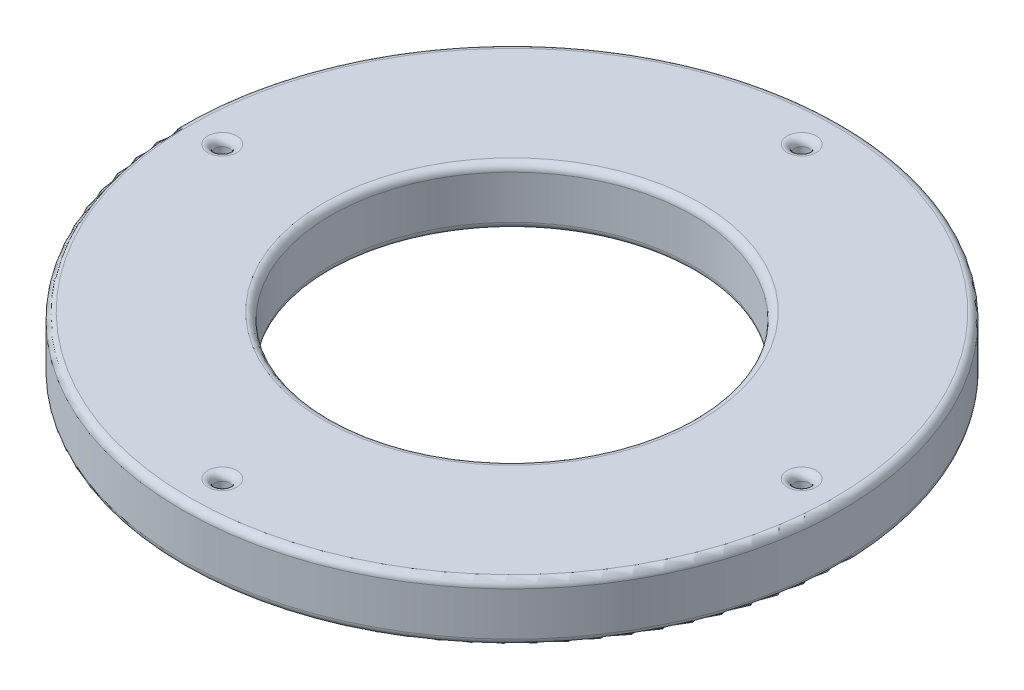
ISO-10303-21;
HEADER;
FILE_DESCRIPTION(('STEP AP214'),'2;1');
FILE_NAME('part.step','',(''),(''),'','','');
FILE_SCHEMA(('AUTOMOTIVE_DESIGN { 1 0 10303 214 1 1 1 1 }'));
ENDSEC;
DATA;
#1=APPLICATION_CONTEXT('core data for automotive mechanical design processes');
#2=APPLICATION_PROTOCOL_DEFINITION('international standard','automotive_design',2000,#1);
#3=PRODUCT_CONTEXT('',#1,'mechanical');
#4=PRODUCT('Part','Part','',(#3));
#5=PRODUCT_RELATED_PRODUCT_CATEGORY('part','',(#4));
#6=PRODUCT_DEFINITION_FORMATION('','',#4);
#7=PRODUCT_DEFINITION_CONTEXT('part definition',#1,'design');
#8=PRODUCT_DEFINITION('design','',#6,#7);
#9=PRODUCT_DEFINITION_SHAPE('','',#8);
#10=(LENGTH_UNIT() NAMED_UNIT(*) SI_UNIT(.MILLI.,.METRE.));
#11=(NAMED_UNIT(*) PLANE_ANGLE_UNIT() SI_UNIT($,.RADIAN.));
#12=(NAMED_UNIT(*) SI_UNIT($,.STERADIAN.) SOLID_ANGLE_UNIT());
#13=UNCERTAINTY_MEASURE_WITH_UNIT(LENGTH_MEASURE(1.E-05),#10,'distance_accuracy_value','');
#14=(GEOMETRIC_REPRESENTATION_CONTEXT(3) GLOBAL_UNCERTAINTY_ASSIGNED_CONTEXT((#13)) GLOBAL_UNIT_ASSIGNED_CONTEXT((#10,
#11,#12)) REPRESENTATION_CONTEXT('',''));
#15=CARTESIAN_POINT('',(0.,0.,0.));
#16=DIRECTION('',(0.,0.,1.));
#17=DIRECTION('',(1.,0.,0.));
#18=AXIS2_PLACEMENT_3D('',#15,#16,#17);
#19=CARTESIAN_POINT('',(0.,4.,0.));
#20=DIRECTION('',(0.,1.,0.));
#21=DIRECTION('',(0.,0.,1.));
#22=AXIS2_PLACEMENT_3D('',#19,#20,#21);
#23=PLANE('',#22);
#24=CARTESIAN_POINT('',(20.,4.,0.));
#25=DIRECTION('',(0.,1.,0.));
#26=DIRECTION('',(0.,0.,1.));
#27=AXIS2_PLACEMENT_3D('',#24,#25,#26);
#28=CIRCLE('',#27,0.999999999999999);
#29=CARTESIAN_POINT('',(20.,4.,0.999999999999999));
#30=VERTEX_POINT('',#29);
#31=EDGE_CURVE('E70',#30,#30,#28,.F.);
#32=ORIENTED_EDGE('',*,*,#31,.T.);
#33=EDGE_LOOP('',(#32));
#34=FACE_BOUND('',#33,.T.);
#35=CARTESIAN_POINT('',(2.09488880330588E-13,4.,-20.));
#36=DIRECTION('',(0.,1.,0.));
#37=DIRECTION('',(0.,0.,1.));
#38=AXIS2_PLACEMENT_3D('',#35,#36,#37);
#39=CIRCLE('',#38,0.999999999999998);
#40=CARTESIAN_POINT('',(2.09488880330588E-13,4.,-19.));
#41=VERTEX_POINT('',#40);
#42=EDGE_CURVE('E74',#41,#41,#39,.F.);
#43=ORIENTED_EDGE('',*,*,#42,.T.);
#44=EDGE_LOOP('',(#43));
#45=FACE_BOUND('',#44,.T.);
#46=CARTESIAN_POINT('',(-20.,4.,-1.39659253553725E-13));
#47=DIRECTION('',(0.,1.,0.));
#48=DIRECTION('',(0.,0.,1.));
#49=AXIS2_PLACEMENT_3D('',#46,#47,#48);
#50=CIRCLE('',#49,0.999999999999998);
#51=CARTESIAN_POINT('',(-20.,4.,0.999999999999859));
#52=VERTEX_POINT('',#51);
#53=EDGE_CURVE('E78',#52,#52,#50,.F.);
#54=ORIENTED_EDGE('',*,*,#53,.T.);
#55=EDGE_LOOP('',(#54));
#56=FACE_BOUND('',#55,.T.);
#57=CARTESIAN_POINT('',(0.,4.,20.));
#58=DIRECTION('',(0.,1.,0.));
#59=DIRECTION('',(0.,0.,1.));
#60=AXIS2_PLACEMENT_3D('',#57,#58,#59);
#61=CIRCLE('',#60,0.999999999999999);
#62=CARTESIAN_POINT('',(0.,4.,21.));
#63=VERTEX_POINT('',#62);
#64=EDGE_CURVE('E82',#63,#63,#61,.F.);
#65=ORIENTED_EDGE('',*,*,#64,.T.);
#66=EDGE_LOOP('',(#65));
#67=FACE_BOUND('',#66,.T.);
#68=CARTESIAN_POINT('',(0.,4.,0.));
#69=DIRECTION('',(0.,1.,0.));
#70=DIRECTION('',(0.,0.,1.));
#71=AXIS2_PLACEMENT_3D('',#68,#69,#70);
#72=CIRCLE('',#71,13.);
#73=CARTESIAN_POINT('',(0.,4.,13.));
#74=VERTEX_POINT('',#73);
#75=EDGE_CURVE('E118',#74,#74,#72,.F.);
#76=ORIENTED_EDGE('',*,*,#75,.T.);
#77=EDGE_LOOP('',(#76));
#78=FACE_BOUND('',#77,.T.);
#79=CARTESIAN_POINT('',(0.,4.,0.));
#80=DIRECTION('',(0.,1.,0.));
#81=DIRECTION('',(0.,0.,1.));
#82=AXIS2_PLACEMENT_3D('',#79,#80,#81);
#83=CIRCLE('',#82,22.25);
#84=CARTESIAN_POINT('',(0.,4.,22.25));
#85=VERTEX_POINT('',#84);
#86=EDGE_CURVE('E122',#85,#85,#83,.T.);
#87=ORIENTED_EDGE('',*,*,#86,.T.);
#88=EDGE_LOOP('',(#87));
#89=FACE_BOUND('',#88,.T.);
#90=ADVANCED_FACE('F38',(#34,#45,#56,#67,#78,#89),#23,.T.);
#91=CARTESIAN_POINT('',(0.,0.,0.));
#92=DIRECTION('',(0.,1.,0.));
#93=DIRECTION('',(0.,0.,1.));
#94=AXIS2_PLACEMENT_3D('',#91,#92,#93);
#95=PLANE('',#94);
#96=CARTESIAN_POINT('',(20.,0.,0.));
#97=DIRECTION('',(0.,1.,0.));
#98=DIRECTION('',(0.,0.,1.));
#99=AXIS2_PLACEMENT_3D('',#96,#97,#98);
#100=CIRCLE('',#99,0.999999999999999);
#101=CARTESIAN_POINT('',(20.,0.,0.999999999999999));
#102=VERTEX_POINT('',#101);
#103=EDGE_CURVE('E94',#102,#102,#100,.T.);
#104=ORIENTED_EDGE('',*,*,#103,.T.);
#105=EDGE_LOOP('',(#104));
#106=FACE_BOUND('',#105,.T.);
#107=CARTESIAN_POINT('',(2.09488880330588E-13,0.,-20.));
#108=DIRECTION('',(0.,1.,0.));
#109=DIRECTION('',(0.,0.,1.));
#110=AXIS2_PLACEMENT_3D('',#107,#108,#109);
#111=CIRCLE('',#110,0.999999999999998);
#112=CARTESIAN_POINT('',(2.09488880330588E-13,0.,-19.));
#113=VERTEX_POINT('',#112);
#114=EDGE_CURVE('E98',#113,#113,#111,.T.);
#115=ORIENTED_EDGE('',*,*,#114,.T.);
#116=EDGE_LOOP('',(#115));
#117=FACE_BOUND('',#116,.T.);
#118=CARTESIAN_POINT('',(-20.,0.,-1.39659253553725E-13));
#119=DIRECTION('',(0.,1.,0.));
#120=DIRECTION('',(0.,0.,1.));
#121=AXIS2_PLACEMENT_3D('',#118,#119,#120);
#122=CIRCLE('',#121,0.999999999999998);
#123=CARTESIAN_POINT('',(-20.,0.,0.999999999999859));
#124=VERTEX_POINT('',#123);
#125=EDGE_CURVE('E102',#124,#124,#122,.T.);
#126=ORIENTED_EDGE('',*,*,#125,.T.);
#127=EDGE_LOOP('',(#126));
#128=FACE_BOUND('',#127,.T.);
#129=CARTESIAN_POINT('',(0.,0.,20.));
#130=DIRECTION('',(0.,1.,0.));
#131=DIRECTION('',(0.,0.,1.));
#132=AXIS2_PLACEMENT_3D('',#129,#130,#131);
#133=CIRCLE('',#132,0.999999999999999);
#134=CARTESIAN_POINT('',(0.,0.,21.));
#135=VERTEX_POINT('',#134);
#136=EDGE_CURVE('E106',#135,#135,#133,.T.);
#137=ORIENTED_EDGE('',*,*,#136,.T.);
#138=EDGE_LOOP('',(#137));
#139=FACE_BOUND('',#138,.T.);
#140=CARTESIAN_POINT('',(0.,0.,0.));
#141=DIRECTION('',(0.,1.,0.));
#142=DIRECTION('',(0.,0.,1.));
#143=AXIS2_PLACEMENT_3D('',#140,#141,#142);
#144=CIRCLE('',#143,13.);
#145=CARTESIAN_POINT('',(0.,0.,13.));
#146=VERTEX_POINT('',#145);
#147=EDGE_CURVE('E134',#146,#146,#144,.T.);
#148=ORIENTED_EDGE('',*,*,#147,.T.);
#149=EDGE_LOOP('',(#148));
#150=FACE_BOUND('',#149,.T.);
#151=CARTESIAN_POINT('',(0.,0.,0.));
#152=DIRECTION('',(0.,1.,0.));
#153=DIRECTION('',(0.,0.,1.));
#154=AXIS2_PLACEMENT_3D('',#151,#152,#153);
#155=CIRCLE('',#154,22.25);
#156=CARTESIAN_POINT('',(0.,0.,22.25));
#157=VERTEX_POINT('',#156);
#158=EDGE_CURVE('E138',#157,#157,#155,.F.);
#159=ORIENTED_EDGE('',*,*,#158,.T.);
#160=EDGE_LOOP('',(#159));
#161=FACE_BOUND('',#160,.T.);
#162=ADVANCED_FACE('F143',(#106,#117,#128,#139,#150,#161),#95,.F.);
#163=CARTESIAN_POINT('',(0.,4.,0.));
#164=DIRECTION('',(0.,-1.,0.));
#165=DIRECTION('',(0.,0.,-1.));
#166=AXIS2_PLACEMENT_3D('',#163,#164,#165);
#167=CYLINDRICAL_SURFACE('',#166,22.75);
#168=CARTESIAN_POINT('',(0.,0.5,0.));
#169=DIRECTION('',(0.,1.,0.));
#170=DIRECTION('',(0.,0.,1.));
#171=AXIS2_PLACEMENT_3D('',#168,#169,#170);
#172=CIRCLE('',#171,22.75);
#173=CARTESIAN_POINT('',(0.,0.5,22.75));
#174=VERTEX_POINT('',#173);
#175=EDGE_CURVE('E110',#174,#174,#172,.T.);
#176=ORIENTED_EDGE('',*,*,#175,.T.);
#177=EDGE_LOOP('',(#176));
#178=FACE_BOUND('',#177,.T.);
#179=CARTESIAN_POINT('',(0.,3.5,0.));
#180=DIRECTION('',(0.,1.,0.));
#181=DIRECTION('',(0.,0.,1.));
#182=AXIS2_PLACEMENT_3D('',#179,#180,#181);
#183=CIRCLE('',#182,22.75);
#184=CARTESIAN_POINT('',(0.,3.5,22.75));
#185=VERTEX_POINT('',#184);
#186=EDGE_CURVE('E114',#185,#185,#183,.F.);
#187=ORIENTED_EDGE('',*,*,#186,.T.);
#188=EDGE_LOOP('',(#187));
#189=FACE_BOUND('',#188,.T.);
#190=ADVANCED_FACE('F153',(#178,#189),#167,.T.);
#191=CARTESIAN_POINT('',(0.,4.,0.));
#192=DIRECTION('',(0.,-1.,0.));
#193=DIRECTION('',(0.,0.,-1.));
#194=AXIS2_PLACEMENT_3D('',#191,#192,#193);
#195=CYLINDRICAL_SURFACE('',#194,12.5);
#196=CARTESIAN_POINT('',(0.,0.5,0.));
#197=DIRECTION('',(0.,1.,0.));
#198=DIRECTION('',(0.,0.,1.));
#199=AXIS2_PLACEMENT_3D('',#196,#197,#198);
#200=CIRCLE('',#199,12.5);
#201=CARTESIAN_POINT('',(0.,0.5,12.5));
#202=VERTEX_POINT('',#201);
#203=EDGE_CURVE('E126',#202,#202,#200,.F.);
#204=ORIENTED_EDGE('',*,*,#203,.T.);
#205=EDGE_LOOP('',(#204));
#206=FACE_BOUND('',#205,.T.);
#207=CARTESIAN_POINT('',(0.,3.5,0.));
#208=DIRECTION('',(0.,1.,0.));
#209=DIRECTION('',(0.,0.,1.));
#210=AXIS2_PLACEMENT_3D('',#207,#208,#209);
#211=CIRCLE('',#210,12.5);
#212=CARTESIAN_POINT('',(0.,3.5,12.5));
#213=VERTEX_POINT('',#212);
#214=EDGE_CURVE('E130',#213,#213,#211,.T.);
#215=ORIENTED_EDGE('',*,*,#214,.T.);
#216=EDGE_LOOP('',(#215));
#217=FACE_BOUND('',#216,.T.);
#218=ADVANCED_FACE('F156',(#206,#217),#195,.F.);
#219=CARTESIAN_POINT('',(20.,4.,0.));
#220=DIRECTION('',(0.,-1.,0.));
#221=DIRECTION('',(0.,0.,-1.));
#222=AXIS2_PLACEMENT_3D('',#219,#220,#221);
#223=CYLINDRICAL_SURFACE('',#222,0.499999999999999);
#224=CARTESIAN_POINT('',(20.,0.5,0.));
#225=DIRECTION('',(0.,1.,0.));
#226=DIRECTION('',(0.,0.,1.));
#227=AXIS2_PLACEMENT_3D('',#224,#225,#226);
#228=CIRCLE('',#227,0.499999999999999);
#229=CARTESIAN_POINT('',(20.,0.5,0.499999999999999));
#230=VERTEX_POINT('',#229);
#231=EDGE_CURVE('E86',#230,#230,#228,.F.);
#232=ORIENTED_EDGE('',*,*,#231,.T.);
#233=EDGE_LOOP('',(#232));
#234=FACE_BOUND('',#233,.T.);
#235=CARTESIAN_POINT('',(20.,3.5,0.));
#236=DIRECTION('',(0.,1.,0.));
#237=DIRECTION('',(0.,0.,1.));
#238=AXIS2_PLACEMENT_3D('',#235,#236,#237);
#239=CIRCLE('',#238,0.499999999999999);
#240=CARTESIAN_POINT('',(20.,3.5,0.499999999999999));
#241=VERTEX_POINT('',#240);
#242=EDGE_CURVE('E90',#241,#241,#239,.T.);
#243=ORIENTED_EDGE('',*,*,#242,.T.);
#244=EDGE_LOOP('',(#243));
#245=FACE_BOUND('',#244,.T.);
#246=ADVANCED_FACE('F233',(#234,#245),#223,.F.);
#247=CARTESIAN_POINT('',(0.,4.,20.));
#248=DIRECTION('',(0.,-1.,0.));
#249=DIRECTION('',(0.,0.,-1.));
#250=AXIS2_PLACEMENT_3D('',#247,#248,#249);
#251=CYLINDRICAL_SURFACE('',#250,0.499999999999999);
#252=CARTESIAN_POINT('',(0.,0.5,20.));
#253=DIRECTION('',(0.,1.,0.));
#254=DIRECTION('',(0.,0.,1.));
#255=AXIS2_PLACEMENT_3D('',#252,#253,#254);
#256=CIRCLE('',#255,0.499999999999999);
#257=CARTESIAN_POINT('',(0.,0.5,20.5));
#258=VERTEX_POINT('',#257);
#259=EDGE_CURVE('E10',#258,#258,#256,.F.);
#260=ORIENTED_EDGE('',*,*,#259,.T.);
#261=EDGE_LOOP('',(#260));
#262=FACE_BOUND('',#261,.T.);
#263=CARTESIAN_POINT('',(0.,3.5,20.));
#264=DIRECTION('',(0.,1.,0.));
#265=DIRECTION('',(0.,0.,1.));
#266=AXIS2_PLACEMENT_3D('',#263,#264,#265);
#267=CIRCLE('',#266,0.499999999999999);
#268=CARTESIAN_POINT('',(0.,3.5,20.5));
#269=VERTEX_POINT('',#268);
#270=EDGE_CURVE('E46',#269,#269,#267,.T.);
#271=ORIENTED_EDGE('',*,*,#270,.T.);
#272=EDGE_LOOP('',(#271));
#273=FACE_BOUND('',#272,.T.);
#274=ADVANCED_FACE('F239',(#262,#273),#251,.F.);
#275=CARTESIAN_POINT('',(-20.,4.,-1.39659253553725E-13));
#276=DIRECTION('',(0.,-1.,0.));
#277=DIRECTION('',(0.,0.,-1.));
#278=AXIS2_PLACEMENT_3D('',#275,#276,#277);
#279=CYLINDRICAL_SURFACE('',#278,0.499999999999998);
#280=CARTESIAN_POINT('',(-20.,0.5,-1.39659253553725E-13));
#281=DIRECTION('',(0.,1.,0.));
#282=DIRECTION('',(0.,0.,1.));
#283=AXIS2_PLACEMENT_3D('',#280,#281,#282);
#284=CIRCLE('',#283,0.499999999999998);
#285=CARTESIAN_POINT('',(-20.,0.5,0.499999999999859));
#286=VERTEX_POINT('',#285);
#287=EDGE_CURVE('E51',#286,#286,#284,.F.);
#288=ORIENTED_EDGE('',*,*,#287,.T.);
#289=EDGE_LOOP('',(#288));
#290=FACE_BOUND('',#289,.T.);
#291=CARTESIAN_POINT('',(-20.,3.5,-1.39659253553725E-13));
#292=DIRECTION('',(0.,1.,0.));
#293=DIRECTION('',(0.,0.,1.));
#294=AXIS2_PLACEMENT_3D('',#291,#292,#293);
#295=CIRCLE('',#294,0.499999999999998);
#296=CARTESIAN_POINT('',(-20.,3.5,0.499999999999859));
#297=VERTEX_POINT('',#296);
#298=EDGE_CURVE('E56',#297,#297,#295,.T.);
#299=ORIENTED_EDGE('',*,*,#298,.T.);
#300=EDGE_LOOP('',(#299));
#301=FACE_BOUND('',#300,.T.);
#302=ADVANCED_FACE('F244',(#290,#301),#279,.F.);
#303=CARTESIAN_POINT('',(2.09488880330588E-13,4.,-20.));
#304=DIRECTION('',(0.,-1.,0.));
#305=DIRECTION('',(0.,0.,-1.));
#306=AXIS2_PLACEMENT_3D('',#303,#304,#305);
#307=CYLINDRICAL_SURFACE('',#306,0.499999999999998);
#308=CARTESIAN_POINT('',(2.09488880330588E-13,0.5,-20.));
#309=DIRECTION('',(0.,1.,0.));
#310=DIRECTION('',(0.,0.,1.));
#311=AXIS2_PLACEMENT_3D('',#308,#309,#310);
#312=CIRCLE('',#311,0.499999999999998);
#313=CARTESIAN_POINT('',(2.09488880330588E-13,0.5,-19.5));
#314=VERTEX_POINT('',#313);
#315=EDGE_CURVE('E62',#314,#314,#312,.F.);
#316=ORIENTED_EDGE('',*,*,#315,.T.);
#317=EDGE_LOOP('',(#316));
#318=FACE_BOUND('',#317,.T.);
#319=CARTESIAN_POINT('',(2.09488880330588E-13,3.5,-20.));
#320=DIRECTION('',(0.,1.,0.));
#321=DIRECTION('',(0.,0.,1.));
#322=AXIS2_PLACEMENT_3D('',#319,#320,#321);
#323=CIRCLE('',#322,0.499999999999998);
#324=CARTESIAN_POINT('',(2.09488880330588E-13,3.5,-19.5));
#325=VERTEX_POINT('',#324);
#326=EDGE_CURVE('E66',#325,#325,#323,.T.);
#327=ORIENTED_EDGE('',*,*,#326,.T.);
#328=EDGE_LOOP('',(#327));
#329=FACE_BOUND('',#328,.T.);
#330=ADVANCED_FACE('F182',(#318,#329),#307,.F.);
#331=CARTESIAN_POINT('',(0.,0.5,0.));
#332=DIRECTION('',(0.,1.,0.));
#333=DIRECTION('',(0.,0.,1.));
#334=AXIS2_PLACEMENT_3D('',#331,#332,#333);
#335=TOROIDAL_SURFACE('',#334,13.,0.5);
#336=ORIENTED_EDGE('',*,*,#203,.F.);
#337=EDGE_LOOP('',(#336));
#338=FACE_BOUND('',#337,.T.);
#339=ORIENTED_EDGE('',*,*,#147,.F.);
#340=EDGE_LOOP('',(#339));
#341=FACE_BOUND('',#340,.T.);
#342=ADVANCED_FACE('F179',(#338,#341),#335,.T.);
#343=CARTESIAN_POINT('',(0.,3.5,0.));
#344=DIRECTION('',(0.,1.,0.));
#345=DIRECTION('',(0.,0.,1.));
#346=AXIS2_PLACEMENT_3D('',#343,#344,#345);
#347=TOROIDAL_SURFACE('',#346,13.,0.5);
#348=ORIENTED_EDGE('',*,*,#75,.F.);
#349=EDGE_LOOP('',(#348));
#350=FACE_BOUND('',#349,.T.);
#351=ORIENTED_EDGE('',*,*,#214,.F.);
#352=EDGE_LOOP('',(#351));
#353=FACE_BOUND('',#352,.T.);
#354=ADVANCED_FACE('F149',(#350,#353),#347,.T.);
#355=CARTESIAN_POINT('',(0.,0.5,0.));
#356=DIRECTION('',(0.,1.,0.));
#357=DIRECTION('',(0.,0.,1.));
#358=AXIS2_PLACEMENT_3D('',#355,#356,#357);
#359=TOROIDAL_SURFACE('',#358,22.25,0.5);
#360=ORIENTED_EDGE('',*,*,#158,.F.);
#361=EDGE_LOOP('',(#360));
#362=FACE_BOUND('',#361,.T.);
#363=ORIENTED_EDGE('',*,*,#175,.F.);
#364=EDGE_LOOP('',(#363));
#365=FACE_BOUND('',#364,.T.);
#366=ADVANCED_FACE('F145',(#362,#365),#359,.T.);
#367=CARTESIAN_POINT('',(0.,3.5,0.));
#368=DIRECTION('',(0.,1.,0.));
#369=DIRECTION('',(0.,0.,1.));
#370=AXIS2_PLACEMENT_3D('',#367,#368,#369);
#371=TOROIDAL_SURFACE('',#370,22.25,0.5);
#372=ORIENTED_EDGE('',*,*,#186,.F.);
#373=EDGE_LOOP('',(#372));
#374=FACE_BOUND('',#373,.T.);
#375=ORIENTED_EDGE('',*,*,#86,.F.);
#376=EDGE_LOOP('',(#375));
#377=FACE_BOUND('',#376,.T.);
#378=ADVANCED_FACE('F148',(#374,#377),#371,.T.);
#379=CARTESIAN_POINT('',(20.,0.5,0.));
#380=DIRECTION('',(0.,1.,0.));
#381=DIRECTION('',(0.,0.,1.));
#382=AXIS2_PLACEMENT_3D('',#379,#380,#381);
#383=TOROIDAL_SURFACE('',#382,0.999999999999999,0.5);
#384=ORIENTED_EDGE('',*,*,#231,.F.);
#385=EDGE_LOOP('',(#384));
#386=FACE_BOUND('',#385,.T.);
#387=ORIENTED_EDGE('',*,*,#103,.F.);
#388=EDGE_LOOP('',(#387));
#389=FACE_BOUND('',#388,.T.);
#390=ADVANCED_FACE('F162',(#386,#389),#383,.T.);
#391=CARTESIAN_POINT('',(20.,3.5,0.));
#392=DIRECTION('',(0.,1.,0.));
#393=DIRECTION('',(0.,0.,1.));
#394=AXIS2_PLACEMENT_3D('',#391,#392,#393);
#395=TOROIDAL_SURFACE('',#394,0.999999999999999,0.5);
#396=ORIENTED_EDGE('',*,*,#31,.F.);
#397=EDGE_LOOP('',(#396));
#398=FACE_BOUND('',#397,.T.);
#399=ORIENTED_EDGE('',*,*,#242,.F.);
#400=EDGE_LOOP('',(#399));
#401=FACE_BOUND('',#400,.T.);
#402=ADVANCED_FACE('F189',(#398,#401),#395,.T.);
#403=CARTESIAN_POINT('',(2.09488880330588E-13,0.5,-20.));
#404=DIRECTION('',(0.,1.,0.));
#405=DIRECTION('',(0.,0.,1.));
#406=AXIS2_PLACEMENT_3D('',#403,#404,#405);
#407=TOROIDAL_SURFACE('',#406,0.999999999999998,0.5);
#408=ORIENTED_EDGE('',*,*,#315,.F.);
#409=EDGE_LOOP('',(#408));
#410=FACE_BOUND('',#409,.T.);
#411=ORIENTED_EDGE('',*,*,#114,.F.);
#412=EDGE_LOOP('',(#411));
#413=FACE_BOUND('',#412,.T.);
#414=ADVANCED_FACE('F193',(#410,#413),#407,.T.);
#415=CARTESIAN_POINT('',(2.09488880330588E-13,3.5,-20.));
#416=DIRECTION('',(0.,1.,0.));
#417=DIRECTION('',(0.,0.,1.));
#418=AXIS2_PLACEMENT_3D('',#415,#416,#417);
#419=TOROIDAL_SURFACE('',#418,0.999999999999998,0.5);
#420=ORIENTED_EDGE('',*,*,#42,.F.);
#421=EDGE_LOOP('',(#420));
#422=FACE_BOUND('',#421,.T.);
#423=ORIENTED_EDGE('',*,*,#326,.F.);
#424=EDGE_LOOP('',(#423));
#425=FACE_BOUND('',#424,.T.);
#426=ADVANCED_FACE('F197',(#422,#425),#419,.T.);
#427=CARTESIAN_POINT('',(-20.,0.5,-1.39659253553725E-13));
#428=DIRECTION('',(0.,1.,0.));
#429=DIRECTION('',(0.,0.,1.));
#430=AXIS2_PLACEMENT_3D('',#427,#428,#429);
#431=TOROIDAL_SURFACE('',#430,0.999999999999998,0.5);
#432=ORIENTED_EDGE('',*,*,#287,.F.);
#433=EDGE_LOOP('',(#432));
#434=FACE_BOUND('',#433,.T.);
#435=ORIENTED_EDGE('',*,*,#125,.F.);
#436=EDGE_LOOP('',(#435));
#437=FACE_BOUND('',#436,.T.);
#438=ADVANCED_FACE('F201',(#434,#437),#431,.T.);
#439=CARTESIAN_POINT('',(-20.,3.5,-1.39659253553725E-13));
#440=DIRECTION('',(0.,1.,0.));
#441=DIRECTION('',(0.,0.,1.));
#442=AXIS2_PLACEMENT_3D('',#439,#440,#441);
#443=TOROIDAL_SURFACE('',#442,0.999999999999998,0.5);
#444=ORIENTED_EDGE('',*,*,#53,.F.);
#445=EDGE_LOOP('',(#444));
#446=FACE_BOUND('',#445,.T.);
#447=ORIENTED_EDGE('',*,*,#298,.F.);
#448=EDGE_LOOP('',(#447));
#449=FACE_BOUND('',#448,.T.);
#450=ADVANCED_FACE('F205',(#446,#449),#443,.T.);
#451=CARTESIAN_POINT('',(0.,0.5,20.));
#452=DIRECTION('',(0.,1.,0.));
#453=DIRECTION('',(0.,0.,1.));
#454=AXIS2_PLACEMENT_3D('',#451,#452,#453);
#455=TOROIDAL_SURFACE('',#454,0.999999999999999,0.5);
#456=ORIENTED_EDGE('',*,*,#259,.F.);
#457=EDGE_LOOP('',(#456));
#458=FACE_BOUND('',#457,.T.);
#459=ORIENTED_EDGE('',*,*,#136,.F.);
#460=EDGE_LOOP('',(#459));
#461=FACE_BOUND('',#460,.T.);
#462=ADVANCED_FACE('F208',(#458,#461),#455,.T.);
#463=CARTESIAN_POINT('',(0.,3.5,20.));
#464=DIRECTION('',(0.,1.,0.));
#465=DIRECTION('',(0.,0.,1.));
#466=AXIS2_PLACEMENT_3D('',#463,#464,#465);
#467=TOROIDAL_SURFACE('',#466,0.999999999999999,0.5);
#468=ORIENTED_EDGE('',*,*,#64,.F.);
#469=EDGE_LOOP('',(#468));
#470=FACE_BOUND('',#469,.T.);
#471=ORIENTED_EDGE('',*,*,#270,.F.);
#472=EDGE_LOOP('',(#471));
#473=FACE_BOUND('',#472,.T.);
#474=ADVANCED_FACE('F40',(#470,#473),#467,.T.);
#475=CLOSED_SHELL('',(#90,#162,#190,#218,#246,#274,#302,#330,#342,#354,#366,#378,#390,#402,#414,
#426,#438,#450,#462,#474));
#476=MANIFOLD_SOLID_BREP('B2',#475);
#477=ADVANCED_BREP_SHAPE_REPRESENTATION('',(#18,#476),#14);
#478=SHAPE_DEFINITION_REPRESENTATION(#9,#477);
ENDSEC;
END-ISO-10303-21;
